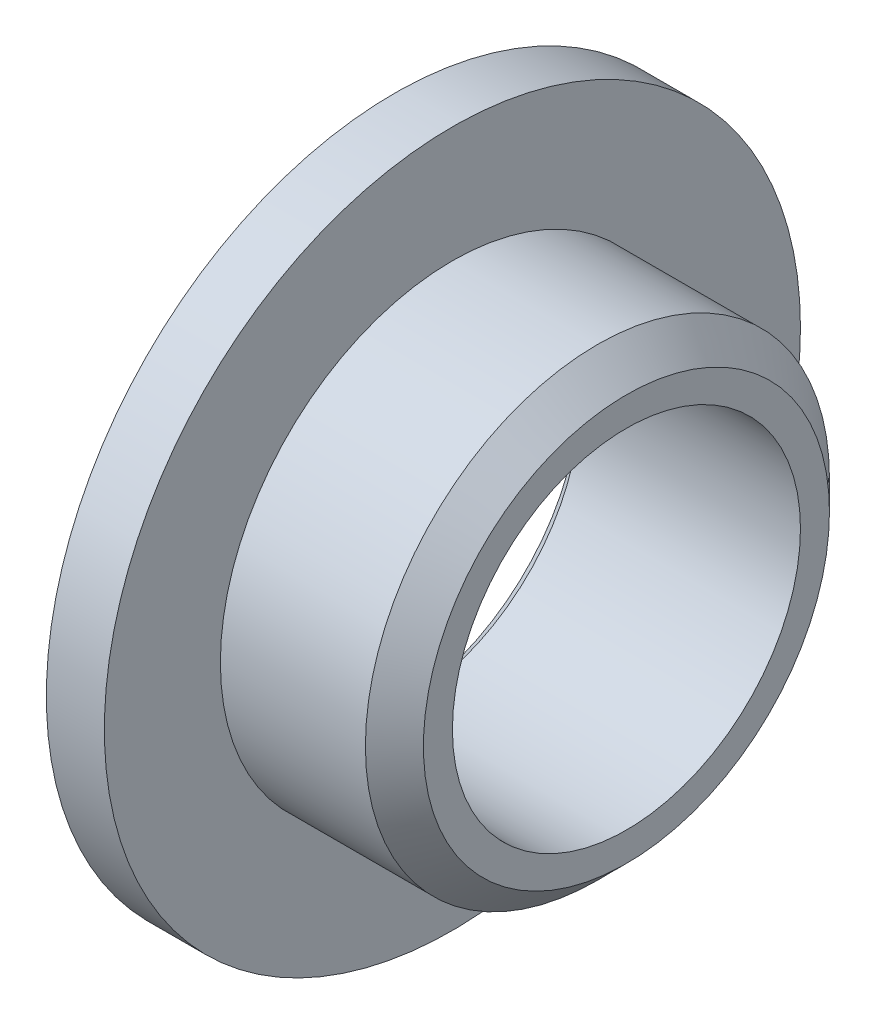
ISO-10303-21;
HEADER;
FILE_DESCRIPTION(('STEP AP214'),'2;1');
FILE_NAME('part.step','',(''),(''),'','','');
FILE_SCHEMA(('AUTOMOTIVE_DESIGN { 1 0 10303 214 1 1 1 1 }'));
ENDSEC;
DATA;
#1=APPLICATION_CONTEXT('core data for automotive mechanical design processes');
#2=APPLICATION_PROTOCOL_DEFINITION('international standard','automotive_design',2000,#1);
#3=PRODUCT_CONTEXT('',#1,'mechanical');
#4=PRODUCT('Part','Part','',(#3));
#5=PRODUCT_RELATED_PRODUCT_CATEGORY('part','',(#4));
#6=PRODUCT_DEFINITION_FORMATION('','',#4);
#7=PRODUCT_DEFINITION_CONTEXT('part definition',#1,'design');
#8=PRODUCT_DEFINITION('design','',#6,#7);
#9=PRODUCT_DEFINITION_SHAPE('','',#8);
#10=(LENGTH_UNIT() NAMED_UNIT(*) SI_UNIT(.MILLI.,.METRE.));
#11=(NAMED_UNIT(*) PLANE_ANGLE_UNIT() SI_UNIT($,.RADIAN.));
#12=(NAMED_UNIT(*) SI_UNIT($,.STERADIAN.) SOLID_ANGLE_UNIT());
#13=UNCERTAINTY_MEASURE_WITH_UNIT(LENGTH_MEASURE(1.E-05),#10,'distance_accuracy_value','');
#14=(GEOMETRIC_REPRESENTATION_CONTEXT(3) GLOBAL_UNCERTAINTY_ASSIGNED_CONTEXT((#13)) GLOBAL_UNIT_ASSIGNED_CONTEXT((#10,
#11,#12)) REPRESENTATION_CONTEXT('',''));
#15=CARTESIAN_POINT('',(0.,0.,0.));
#16=DIRECTION('',(0.,0.,1.));
#17=DIRECTION('',(1.,0.,0.));
#18=AXIS2_PLACEMENT_3D('',#15,#16,#17);
#19=CARTESIAN_POINT('',(0.,0.,0.));
#20=DIRECTION('',(1.,0.,0.));
#21=DIRECTION('',(0.,0.,-1.));
#22=AXIS2_PLACEMENT_3D('',#19,#20,#21);
#23=CYLINDRICAL_SURFACE('',#22,6.);
#24=CARTESIAN_POINT('',(0.,0.,0.));
#25=DIRECTION('',(1.,0.,0.));
#26=DIRECTION('',(0.,0.,-1.));
#27=AXIS2_PLACEMENT_3D('',#24,#25,#26);
#28=CIRCLE('',#27,6.);
#29=CARTESIAN_POINT('',(0.,0.,-6.));
#30=VERTEX_POINT('',#29);
#31=EDGE_CURVE('E10',#30,#30,#28,.T.);
#32=ORIENTED_EDGE('',*,*,#31,.T.);
#33=EDGE_LOOP('',(#32));
#34=FACE_BOUND('',#33,.T.);
#35=CARTESIAN_POINT('',(1.,0.,0.));
#36=DIRECTION('',(1.,0.,0.));
#37=DIRECTION('',(0.,0.,-1.));
#38=AXIS2_PLACEMENT_3D('',#35,#36,#37);
#39=CIRCLE('',#38,6.);
#40=CARTESIAN_POINT('',(1.,0.,-6.));
#41=VERTEX_POINT('',#40);
#42=EDGE_CURVE('E63',#41,#41,#39,.T.);
#43=ORIENTED_EDGE('',*,*,#42,.F.);
#44=EDGE_LOOP('',(#43));
#45=FACE_BOUND('',#44,.T.);
#46=ADVANCED_FACE('F35',(#34,#45),#23,.T.);
#47=CARTESIAN_POINT('',(0.,6.,0.));
#48=DIRECTION('',(-1.,0.,0.));
#49=DIRECTION('',(0.,0.,1.));
#50=AXIS2_PLACEMENT_3D('',#47,#48,#49);
#51=PLANE('',#50);
#52=CARTESIAN_POINT('',(0.,0.,0.));
#53=DIRECTION('',(1.,0.,0.));
#54=DIRECTION('',(0.,0.,-1.));
#55=AXIS2_PLACEMENT_3D('',#52,#53,#54);
#56=CIRCLE('',#55,3.2);
#57=CARTESIAN_POINT('',(0.,0.,-3.2));
#58=VERTEX_POINT('',#57);
#59=EDGE_CURVE('E41',#58,#58,#56,.T.);
#60=ORIENTED_EDGE('',*,*,#59,.T.);
#61=EDGE_LOOP('',(#60));
#62=FACE_BOUND('',#61,.T.);
#63=ORIENTED_EDGE('',*,*,#31,.F.);
#64=EDGE_LOOP('',(#63));
#65=FACE_BOUND('',#64,.T.);
#66=ADVANCED_FACE('F71',(#62,#65),#51,.T.);
#67=CARTESIAN_POINT('',(0.,0.,0.));
#68=DIRECTION('',(-1.,0.,0.));
#69=DIRECTION('',(0.,0.,1.));
#70=AXIS2_PLACEMENT_3D('',#67,#68,#69);
#71=CONICAL_SURFACE('',#70,3.2,0.785398163397448);
#72=CARTESIAN_POINT('',(0.2,0.,0.));
#73=DIRECTION('',(1.,0.,0.));
#74=DIRECTION('',(0.,0.,-1.));
#75=AXIS2_PLACEMENT_3D('',#72,#73,#74);
#76=CIRCLE('',#75,3.);
#77=CARTESIAN_POINT('',(0.2,0.,-3.));
#78=VERTEX_POINT('',#77);
#79=EDGE_CURVE('E45',#78,#78,#76,.T.);
#80=ORIENTED_EDGE('',*,*,#79,.T.);
#81=EDGE_LOOP('',(#80));
#82=FACE_BOUND('',#81,.T.);
#83=ORIENTED_EDGE('',*,*,#59,.F.);
#84=EDGE_LOOP('',(#83));
#85=FACE_BOUND('',#84,.T.);
#86=ADVANCED_FACE('F75',(#82,#85),#71,.F.);
#87=CARTESIAN_POINT('',(0.,0.,0.));
#88=DIRECTION('',(1.,0.,0.));
#89=DIRECTION('',(0.,0.,-1.));
#90=AXIS2_PLACEMENT_3D('',#87,#88,#89);
#91=CYLINDRICAL_SURFACE('',#90,3.);
#92=CARTESIAN_POINT('',(4.,0.,0.));
#93=DIRECTION('',(1.,0.,0.));
#94=DIRECTION('',(0.,0.,-1.));
#95=AXIS2_PLACEMENT_3D('',#92,#93,#94);
#96=CIRCLE('',#95,3.);
#97=CARTESIAN_POINT('',(4.,0.,-3.));
#98=VERTEX_POINT('',#97);
#99=EDGE_CURVE('E49',#98,#98,#96,.T.);
#100=ORIENTED_EDGE('',*,*,#99,.T.);
#101=EDGE_LOOP('',(#100));
#102=FACE_BOUND('',#101,.T.);
#103=ORIENTED_EDGE('',*,*,#79,.F.);
#104=EDGE_LOOP('',(#103));
#105=FACE_BOUND('',#104,.T.);
#106=ADVANCED_FACE('F79',(#102,#105),#91,.F.);
#107=CARTESIAN_POINT('',(4.,3.,0.));
#108=DIRECTION('',(1.,0.,0.));
#109=DIRECTION('',(0.,0.,-1.));
#110=AXIS2_PLACEMENT_3D('',#107,#108,#109);
#111=PLANE('',#110);
#112=CARTESIAN_POINT('',(4.,0.,0.));
#113=DIRECTION('',(1.,0.,0.));
#114=DIRECTION('',(0.,0.,-1.));
#115=AXIS2_PLACEMENT_3D('',#112,#113,#114);
#116=CIRCLE('',#115,3.5);
#117=CARTESIAN_POINT('',(4.,0.,-3.5));
#118=VERTEX_POINT('',#117);
#119=EDGE_CURVE('E54',#118,#118,#116,.T.);
#120=ORIENTED_EDGE('',*,*,#119,.T.);
#121=EDGE_LOOP('',(#120));
#122=FACE_BOUND('',#121,.T.);
#123=ORIENTED_EDGE('',*,*,#99,.F.);
#124=EDGE_LOOP('',(#123));
#125=FACE_BOUND('',#124,.T.);
#126=ADVANCED_FACE('F86',(#122,#125),#111,.T.);
#127=CARTESIAN_POINT('',(4.,0.,0.));
#128=DIRECTION('',(-1.,0.,0.));
#129=DIRECTION('',(0.,0.,1.));
#130=AXIS2_PLACEMENT_3D('',#127,#128,#129);
#131=CONICAL_SURFACE('',#130,3.5,0.785398163397448);
#132=CARTESIAN_POINT('',(3.5,0.,0.));
#133=DIRECTION('',(1.,0.,0.));
#134=DIRECTION('',(0.,0.,-1.));
#135=AXIS2_PLACEMENT_3D('',#132,#133,#134);
#136=CIRCLE('',#135,4.);
#137=CARTESIAN_POINT('',(3.5,0.,-4.));
#138=VERTEX_POINT('',#137);
#139=EDGE_CURVE('E57',#138,#138,#136,.T.);
#140=ORIENTED_EDGE('',*,*,#139,.T.);
#141=EDGE_LOOP('',(#140));
#142=FACE_BOUND('',#141,.T.);
#143=ORIENTED_EDGE('',*,*,#119,.F.);
#144=EDGE_LOOP('',(#143));
#145=FACE_BOUND('',#144,.T.);
#146=ADVANCED_FACE('F90',(#142,#145),#131,.T.);
#147=CARTESIAN_POINT('',(0.,0.,0.));
#148=DIRECTION('',(1.,0.,0.));
#149=DIRECTION('',(0.,0.,-1.));
#150=AXIS2_PLACEMENT_3D('',#147,#148,#149);
#151=CYLINDRICAL_SURFACE('',#150,4.);
#152=CARTESIAN_POINT('',(1.,0.,0.));
#153=DIRECTION('',(1.,0.,0.));
#154=DIRECTION('',(0.,0.,-1.));
#155=AXIS2_PLACEMENT_3D('',#152,#153,#154);
#156=CIRCLE('',#155,4.);
#157=CARTESIAN_POINT('',(1.,0.,-4.));
#158=VERTEX_POINT('',#157);
#159=EDGE_CURVE('E60',#158,#158,#156,.T.);
#160=ORIENTED_EDGE('',*,*,#159,.T.);
#161=EDGE_LOOP('',(#160));
#162=FACE_BOUND('',#161,.T.);
#163=ORIENTED_EDGE('',*,*,#139,.F.);
#164=EDGE_LOOP('',(#163));
#165=FACE_BOUND('',#164,.T.);
#166=ADVANCED_FACE('F94',(#162,#165),#151,.T.);
#167=CARTESIAN_POINT('',(1.,4.,0.));
#168=DIRECTION('',(1.,0.,0.));
#169=DIRECTION('',(0.,0.,-1.));
#170=AXIS2_PLACEMENT_3D('',#167,#168,#169);
#171=PLANE('',#170);
#172=ORIENTED_EDGE('',*,*,#42,.T.);
#173=EDGE_LOOP('',(#172));
#174=FACE_BOUND('',#173,.T.);
#175=ORIENTED_EDGE('',*,*,#159,.F.);
#176=EDGE_LOOP('',(#175));
#177=FACE_BOUND('',#176,.T.);
#178=ADVANCED_FACE('F67',(#174,#177),#171,.T.);
#179=CLOSED_SHELL('',(#46,#66,#86,#106,#126,#146,#166,#178));
#180=MANIFOLD_SOLID_BREP('B2',#179);
#181=ADVANCED_BREP_SHAPE_REPRESENTATION('',(#18,#180),#14);
#182=SHAPE_DEFINITION_REPRESENTATION(#9,#181);
ENDSEC;
END-ISO-10303-21;
